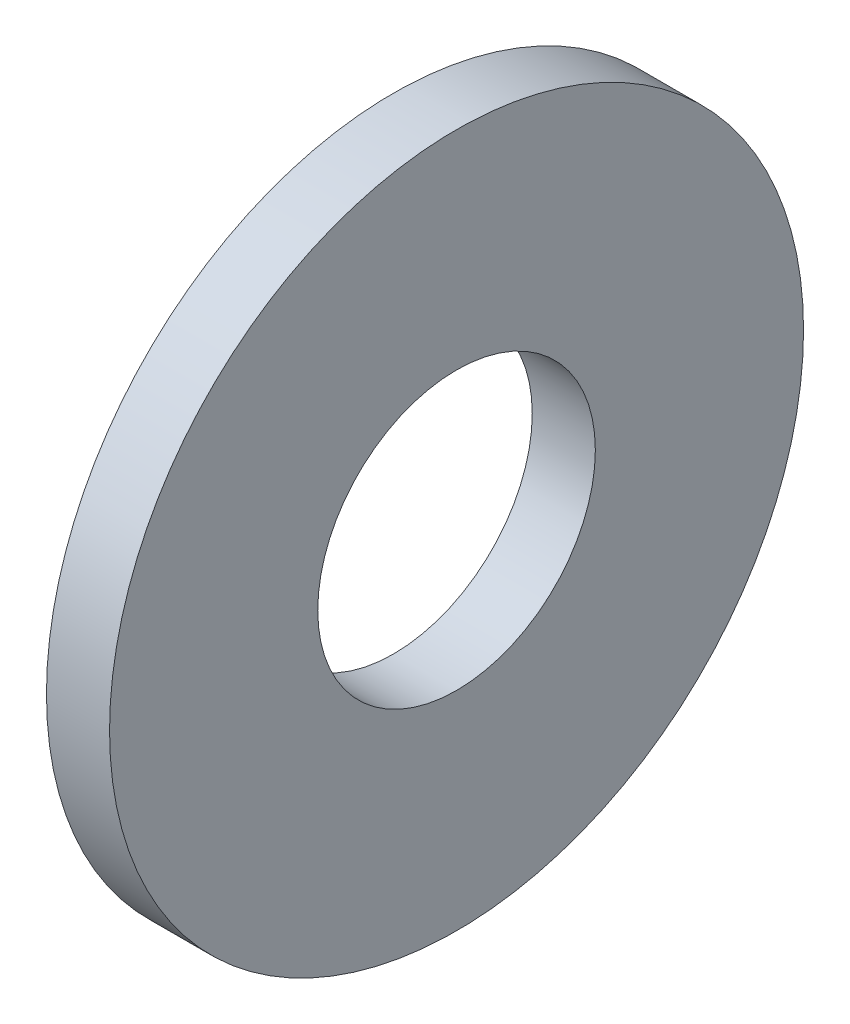
ISO-10303-21;
HEADER;
FILE_DESCRIPTION(('STEP AP214'),'2;1');
FILE_NAME('part.step','',(''),(''),'','','');
FILE_SCHEMA(('AUTOMOTIVE_DESIGN { 1 0 10303 214 1 1 1 1 }'));
ENDSEC;
DATA;
#1=APPLICATION_CONTEXT('core data for automotive mechanical design processes');
#2=APPLICATION_PROTOCOL_DEFINITION('international standard','automotive_design',2000,#1);
#3=PRODUCT_CONTEXT('',#1,'mechanical');
#4=PRODUCT('Part','Part','',(#3));
#5=PRODUCT_RELATED_PRODUCT_CATEGORY('part','',(#4));
#6=PRODUCT_DEFINITION_FORMATION('','',#4);
#7=PRODUCT_DEFINITION_CONTEXT('part definition',#1,'design');
#8=PRODUCT_DEFINITION('design','',#6,#7);
#9=PRODUCT_DEFINITION_SHAPE('','',#8);
#10=(LENGTH_UNIT() NAMED_UNIT(*) SI_UNIT(.MILLI.,.METRE.));
#11=(NAMED_UNIT(*) PLANE_ANGLE_UNIT() SI_UNIT($,.RADIAN.));
#12=(NAMED_UNIT(*) SI_UNIT($,.STERADIAN.) SOLID_ANGLE_UNIT());
#13=UNCERTAINTY_MEASURE_WITH_UNIT(LENGTH_MEASURE(1.E-05),#10,'distance_accuracy_value','');
#14=(GEOMETRIC_REPRESENTATION_CONTEXT(3) GLOBAL_UNCERTAINTY_ASSIGNED_CONTEXT((#13)) GLOBAL_UNIT_ASSIGNED_CONTEXT((#10,
#11,#12)) REPRESENTATION_CONTEXT('',''));
#15=CARTESIAN_POINT('',(0.,0.,0.));
#16=DIRECTION('',(0.,0.,1.));
#17=DIRECTION('',(1.,0.,0.));
#18=AXIS2_PLACEMENT_3D('',#15,#16,#17);
#19=CARTESIAN_POINT('',(0.5,0.,0.));
#20=DIRECTION('',(-1.,0.,0.));
#21=DIRECTION('',(0.,0.,1.));
#22=AXIS2_PLACEMENT_3D('',#19,#20,#21);
#23=CYLINDRICAL_SURFACE('',#22,2.75);
#24=CARTESIAN_POINT('',(0.5,0.,0.));
#25=DIRECTION('',(-1.,0.,0.));
#26=DIRECTION('',(0.,0.,1.));
#27=AXIS2_PLACEMENT_3D('',#24,#25,#26);
#28=CIRCLE('',#27,2.75);
#29=CARTESIAN_POINT('',(0.5,0.,2.75));
#30=VERTEX_POINT('',#29);
#31=EDGE_CURVE('E10',#30,#30,#28,.T.);
#32=ORIENTED_EDGE('',*,*,#31,.T.);
#33=EDGE_LOOP('',(#32));
#34=FACE_BOUND('',#33,.T.);
#35=CARTESIAN_POINT('',(0.,0.,0.));
#36=DIRECTION('',(-1.,0.,0.));
#37=DIRECTION('',(0.,0.,1.));
#38=AXIS2_PLACEMENT_3D('',#35,#36,#37);
#39=CIRCLE('',#38,2.75);
#40=CARTESIAN_POINT('',(0.,0.,2.75));
#41=VERTEX_POINT('',#40);
#42=EDGE_CURVE('E51',#41,#41,#39,.T.);
#43=ORIENTED_EDGE('',*,*,#42,.F.);
#44=EDGE_LOOP('',(#43));
#45=FACE_BOUND('',#44,.T.);
#46=ADVANCED_FACE('F37',(#34,#45),#23,.T.);
#47=CARTESIAN_POINT('',(0.5,2.75,0.));
#48=DIRECTION('',(1.,0.,0.));
#49=DIRECTION('',(0.,0.,-1.));
#50=AXIS2_PLACEMENT_3D('',#47,#48,#49);
#51=PLANE('',#50);
#52=CARTESIAN_POINT('',(0.5,0.,0.));
#53=DIRECTION('',(-1.,0.,0.));
#54=DIRECTION('',(0.,0.,1.));
#55=AXIS2_PLACEMENT_3D('',#52,#53,#54);
#56=CIRCLE('',#55,1.1);
#57=CARTESIAN_POINT('',(0.5,0.,1.1));
#58=VERTEX_POINT('',#57);
#59=EDGE_CURVE('E43',#58,#58,#56,.T.);
#60=ORIENTED_EDGE('',*,*,#59,.T.);
#61=EDGE_LOOP('',(#60));
#62=FACE_BOUND('',#61,.T.);
#63=ORIENTED_EDGE('',*,*,#31,.F.);
#64=EDGE_LOOP('',(#63));
#65=FACE_BOUND('',#64,.T.);
#66=ADVANCED_FACE('F61',(#62,#65),#51,.T.);
#67=CARTESIAN_POINT('',(0.5,0.,0.));
#68=DIRECTION('',(-1.,0.,0.));
#69=DIRECTION('',(0.,0.,1.));
#70=AXIS2_PLACEMENT_3D('',#67,#68,#69);
#71=CYLINDRICAL_SURFACE('',#70,1.1);
#72=CARTESIAN_POINT('',(0.,0.,0.));
#73=DIRECTION('',(-1.,0.,0.));
#74=DIRECTION('',(0.,0.,1.));
#75=AXIS2_PLACEMENT_3D('',#72,#73,#74);
#76=CIRCLE('',#75,1.1);
#77=CARTESIAN_POINT('',(0.,0.,1.1));
#78=VERTEX_POINT('',#77);
#79=EDGE_CURVE('E47',#78,#78,#76,.T.);
#80=ORIENTED_EDGE('',*,*,#79,.T.);
#81=EDGE_LOOP('',(#80));
#82=FACE_BOUND('',#81,.T.);
#83=ORIENTED_EDGE('',*,*,#59,.F.);
#84=EDGE_LOOP('',(#83));
#85=FACE_BOUND('',#84,.T.);
#86=ADVANCED_FACE('F65',(#82,#85),#71,.F.);
#87=CARTESIAN_POINT('',(0.,1.1,0.));
#88=DIRECTION('',(-1.,0.,0.));
#89=DIRECTION('',(0.,0.,1.));
#90=AXIS2_PLACEMENT_3D('',#87,#88,#89);
#91=PLANE('',#90);
#92=ORIENTED_EDGE('',*,*,#42,.T.);
#93=EDGE_LOOP('',(#92));
#94=FACE_BOUND('',#93,.T.);
#95=ORIENTED_EDGE('',*,*,#79,.F.);
#96=EDGE_LOOP('',(#95));
#97=FACE_BOUND('',#96,.T.);
#98=ADVANCED_FACE('F57',(#94,#97),#91,.T.);
#99=CLOSED_SHELL('',(#46,#66,#86,#98));
#100=MANIFOLD_SOLID_BREP('B2',#99);
#101=ADVANCED_BREP_SHAPE_REPRESENTATION('',(#18,#100),#14);
#102=SHAPE_DEFINITION_REPRESENTATION(#9,#101);
ENDSEC;
END-ISO-10303-21;
